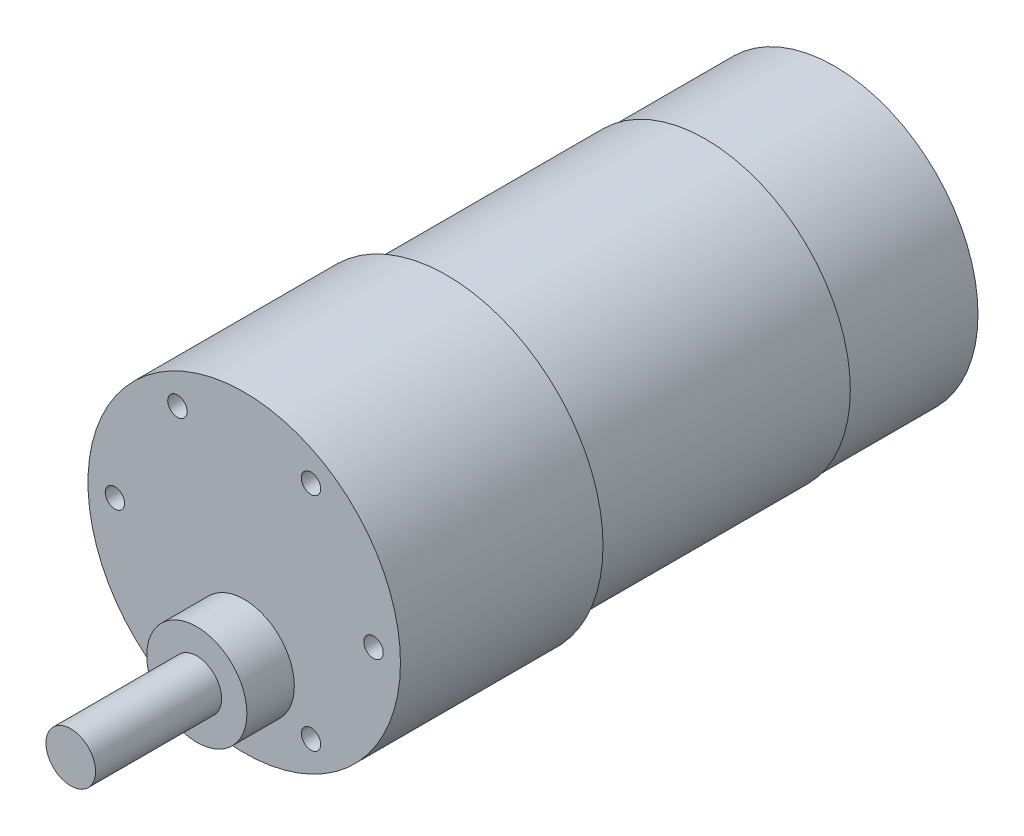
ISO-10303-21;
HEADER;
FILE_DESCRIPTION(('STEP AP214'),'2;1');
FILE_NAME('part.step','',(''),(''),'','','');
FILE_SCHEMA(('AUTOMOTIVE_DESIGN { 1 0 10303 214 1 1 1 1 }'));
ENDSEC;
DATA;
#1=APPLICATION_CONTEXT('core data for automotive mechanical design processes');
#2=APPLICATION_PROTOCOL_DEFINITION('international standard','automotive_design',2000,#1);
#3=PRODUCT_CONTEXT('',#1,'mechanical');
#4=PRODUCT('Part','Part','',(#3));
#5=PRODUCT_RELATED_PRODUCT_CATEGORY('part','',(#4));
#6=PRODUCT_DEFINITION_FORMATION('','',#4);
#7=PRODUCT_DEFINITION_CONTEXT('part definition',#1,'design');
#8=PRODUCT_DEFINITION('design','',#6,#7);
#9=PRODUCT_DEFINITION_SHAPE('','',#8);
#10=(LENGTH_UNIT() NAMED_UNIT(*) SI_UNIT(.MILLI.,.METRE.));
#11=(NAMED_UNIT(*) PLANE_ANGLE_UNIT() SI_UNIT($,.RADIAN.));
#12=(NAMED_UNIT(*) SI_UNIT($,.STERADIAN.) SOLID_ANGLE_UNIT());
#13=UNCERTAINTY_MEASURE_WITH_UNIT(LENGTH_MEASURE(1.E-05),#10,'distance_accuracy_value','');
#14=(GEOMETRIC_REPRESENTATION_CONTEXT(3) GLOBAL_UNCERTAINTY_ASSIGNED_CONTEXT((#13)) GLOBAL_UNIT_ASSIGNED_CONTEXT((#10,
#11,#12)) REPRESENTATION_CONTEXT('',''));
#15=CARTESIAN_POINT('',(0.,0.,0.));
#16=DIRECTION('',(0.,0.,1.));
#17=DIRECTION('',(1.,0.,0.));
#18=AXIS2_PLACEMENT_3D('',#15,#16,#17);
#19=CARTESIAN_POINT('',(0.,0.,-23.876));
#20=DIRECTION('',(0.,0.,1.));
#21=DIRECTION('',(1.,0.,0.));
#22=AXIS2_PLACEMENT_3D('',#19,#20,#21);
#23=CYLINDRICAL_SURFACE('',#22,18.415);
#24=CARTESIAN_POINT('',(0.,0.,-23.876));
#25=DIRECTION('',(0.,0.,1.));
#26=DIRECTION('',(1.,0.,0.));
#27=AXIS2_PLACEMENT_3D('',#24,#25,#26);
#28=CIRCLE('',#27,18.415);
#29=CARTESIAN_POINT('',(18.415,0.,-23.876));
#30=VERTEX_POINT('',#29);
#31=EDGE_CURVE('E160',#30,#30,#28,.T.);
#32=ORIENTED_EDGE('',*,*,#31,.T.);
#33=EDGE_LOOP('',(#32));
#34=FACE_BOUND('',#33,.T.);
#35=CARTESIAN_POINT('',(0.,0.,0.));
#36=DIRECTION('',(0.,0.,1.));
#37=DIRECTION('',(1.,0.,0.));
#38=AXIS2_PLACEMENT_3D('',#35,#36,#37);
#39=CIRCLE('',#38,18.415);
#40=CARTESIAN_POINT('',(18.415,0.,0.));
#41=VERTEX_POINT('',#40);
#42=EDGE_CURVE('E157',#41,#41,#39,.T.);
#43=ORIENTED_EDGE('',*,*,#42,.F.);
#44=EDGE_LOOP('',(#43));
#45=FACE_BOUND('',#44,.T.);
#46=ADVANCED_FACE('F33',(#34,#45),#23,.T.);
#47=CARTESIAN_POINT('',(0.,0.,-23.876));
#48=DIRECTION('',(0.,0.,1.));
#49=DIRECTION('',(1.,0.,0.));
#50=AXIS2_PLACEMENT_3D('',#47,#48,#49);
#51=PLANE('',#50);
#52=CARTESIAN_POINT('',(0.,0.,-23.876));
#53=DIRECTION('',(0.,0.,1.));
#54=DIRECTION('',(1.,0.,0.));
#55=AXIS2_PLACEMENT_3D('',#52,#53,#54);
#56=CIRCLE('',#55,17.0815);
#57=CARTESIAN_POINT('',(17.0815,0.,-23.876));
#58=VERTEX_POINT('',#57);
#59=EDGE_CURVE('E163',#58,#58,#56,.F.);
#60=ORIENTED_EDGE('',*,*,#59,.F.);
#61=EDGE_LOOP('',(#60));
#62=FACE_BOUND('',#61,.T.);
#63=ORIENTED_EDGE('',*,*,#31,.F.);
#64=EDGE_LOOP('',(#63));
#65=FACE_BOUND('',#64,.T.);
#66=ADVANCED_FACE('F187',(#62,#65),#51,.F.);
#67=CARTESIAN_POINT('',(0.,0.,0.));
#68=DIRECTION('',(0.,0.,1.));
#69=DIRECTION('',(1.,0.,0.));
#70=AXIS2_PLACEMENT_3D('',#67,#68,#69);
#71=PLANE('',#70);
#72=CARTESIAN_POINT('',(-7.87188333333333,-13.0495614020698,0.));
#73=DIRECTION('',(0.,0.,1.));
#74=DIRECTION('',(-1.,0.,0.));
#75=AXIS2_PLACEMENT_3D('',#72,#73,#74);
#76=CIRCLE('',#75,1.143);
#77=CARTESIAN_POINT('',(-9.01488333333333,-13.0495614020698,0.));
#78=VERTEX_POINT('',#77);
#79=EDGE_CURVE('E99',#78,#78,#76,.T.);
#80=ORIENTED_EDGE('',*,*,#79,.F.);
#81=EDGE_LOOP('',(#80));
#82=FACE_BOUND('',#81,.T.);
#83=CARTESIAN_POINT('',(-15.24,0.,0.));
#84=DIRECTION('',(0.,0.,1.));
#85=DIRECTION('',(-1.,0.,0.));
#86=AXIS2_PLACEMENT_3D('',#83,#84,#85);
#87=CIRCLE('',#86,1.143);
#88=CARTESIAN_POINT('',(-16.383,0.,0.));
#89=VERTEX_POINT('',#88);
#90=EDGE_CURVE('E106',#89,#89,#87,.T.);
#91=ORIENTED_EDGE('',*,*,#90,.F.);
#92=EDGE_LOOP('',(#91));
#93=FACE_BOUND('',#92,.T.);
#94=CARTESIAN_POINT('',(-7.87188333333333,13.0495614020698,0.));
#95=DIRECTION('',(0.,0.,1.));
#96=DIRECTION('',(-1.,0.,0.));
#97=AXIS2_PLACEMENT_3D('',#94,#95,#96);
#98=CIRCLE('',#97,1.143);
#99=CARTESIAN_POINT('',(-9.01488333333333,13.0495614020698,0.));
#100=VERTEX_POINT('',#99);
#101=EDGE_CURVE('E112',#100,#100,#98,.T.);
#102=ORIENTED_EDGE('',*,*,#101,.F.);
#103=EDGE_LOOP('',(#102));
#104=FACE_BOUND('',#103,.T.);
#105=CARTESIAN_POINT('',(7.87188333333333,13.0495614020698,0.));
#106=DIRECTION('',(0.,0.,1.));
#107=DIRECTION('',(1.,0.,0.));
#108=AXIS2_PLACEMENT_3D('',#105,#106,#107);
#109=CIRCLE('',#108,1.143);
#110=CARTESIAN_POINT('',(9.01488333333333,13.0495614020698,0.));
#111=VERTEX_POINT('',#110);
#112=EDGE_CURVE('E118',#111,#111,#109,.T.);
#113=ORIENTED_EDGE('',*,*,#112,.F.);
#114=EDGE_LOOP('',(#113));
#115=FACE_BOUND('',#114,.T.);
#116=CARTESIAN_POINT('',(15.24,0.,0.));
#117=DIRECTION('',(0.,0.,1.));
#118=DIRECTION('',(1.,0.,0.));
#119=AXIS2_PLACEMENT_3D('',#116,#117,#118);
#120=CIRCLE('',#119,1.143);
#121=CARTESIAN_POINT('',(16.383,0.,0.));
#122=VERTEX_POINT('',#121);
#123=EDGE_CURVE('E124',#122,#122,#120,.T.);
#124=ORIENTED_EDGE('',*,*,#123,.F.);
#125=EDGE_LOOP('',(#124));
#126=FACE_BOUND('',#125,.T.);
#127=CARTESIAN_POINT('',(7.87188333333333,-13.0495614020698,0.));
#128=DIRECTION('',(0.,0.,1.));
#129=DIRECTION('',(1.,0.,0.));
#130=AXIS2_PLACEMENT_3D('',#127,#128,#129);
#131=CIRCLE('',#130,1.143);
#132=CARTESIAN_POINT('',(9.01488333333333,-13.0495614020698,0.));
#133=VERTEX_POINT('',#132);
#134=EDGE_CURVE('E130',#133,#133,#131,.T.);
#135=ORIENTED_EDGE('',*,*,#134,.F.);
#136=EDGE_LOOP('',(#135));
#137=FACE_BOUND('',#136,.T.);
#138=CARTESIAN_POINT('',(0.,-8.636,0.));
#139=DIRECTION('',(0.,0.,1.));
#140=DIRECTION('',(1.,0.,0.));
#141=AXIS2_PLACEMENT_3D('',#138,#139,#140);
#142=CIRCLE('',#141,5.9055);
#143=CARTESIAN_POINT('',(5.9055,-8.636,0.));
#144=VERTEX_POINT('',#143);
#145=EDGE_CURVE('E151',#144,#144,#142,.T.);
#146=ORIENTED_EDGE('',*,*,#145,.F.);
#147=EDGE_LOOP('',(#146));
#148=FACE_BOUND('',#147,.T.);
#149=ORIENTED_EDGE('',*,*,#42,.T.);
#150=EDGE_LOOP('',(#149));
#151=FACE_BOUND('',#150,.T.);
#152=ADVANCED_FACE('F192',(#82,#93,#104,#115,#126,#137,#148,#151),#71,.T.);
#153=CARTESIAN_POINT('',(0.,-8.636,5.588));
#154=DIRECTION('',(0.,0.,-1.));
#155=DIRECTION('',(-1.,0.,0.));
#156=AXIS2_PLACEMENT_3D('',#153,#154,#155);
#157=CYLINDRICAL_SURFACE('',#156,5.9055);
#158=CARTESIAN_POINT('',(0.,-8.636,5.588));
#159=DIRECTION('',(0.,0.,1.));
#160=DIRECTION('',(1.,0.,0.));
#161=AXIS2_PLACEMENT_3D('',#158,#159,#160);
#162=CIRCLE('',#161,5.9055);
#163=CARTESIAN_POINT('',(5.9055,-8.636,5.588));
#164=VERTEX_POINT('',#163);
#165=EDGE_CURVE('E154',#164,#164,#162,.T.);
#166=ORIENTED_EDGE('',*,*,#165,.F.);
#167=EDGE_LOOP('',(#166));
#168=FACE_BOUND('',#167,.T.);
#169=ORIENTED_EDGE('',*,*,#145,.T.);
#170=EDGE_LOOP('',(#169));
#171=FACE_BOUND('',#170,.T.);
#172=ADVANCED_FACE('F200',(#168,#171),#157,.T.);
#173=CARTESIAN_POINT('',(0.,-8.636,5.588));
#174=DIRECTION('',(0.,0.,1.));
#175=DIRECTION('',(1.,0.,0.));
#176=AXIS2_PLACEMENT_3D('',#173,#174,#175);
#177=PLANE('',#176);
#178=CARTESIAN_POINT('',(0.,-8.636,5.588));
#179=DIRECTION('',(0.,0.,1.));
#180=DIRECTION('',(1.,0.,0.));
#181=AXIS2_PLACEMENT_3D('',#178,#179,#180);
#182=CIRCLE('',#181,2.921);
#183=CARTESIAN_POINT('',(2.921,-8.636,5.588));
#184=VERTEX_POINT('',#183);
#185=EDGE_CURVE('E147',#184,#184,#182,.T.);
#186=ORIENTED_EDGE('',*,*,#185,.F.);
#187=EDGE_LOOP('',(#186));
#188=FACE_BOUND('',#187,.T.);
#189=ORIENTED_EDGE('',*,*,#165,.T.);
#190=EDGE_LOOP('',(#189));
#191=FACE_BOUND('',#190,.T.);
#192=ADVANCED_FACE('F205',(#188,#191),#177,.T.);
#193=CARTESIAN_POINT('',(0.,-8.636,20.447));
#194=DIRECTION('',(0.,0.,-1.));
#195=DIRECTION('',(-1.,0.,0.));
#196=AXIS2_PLACEMENT_3D('',#193,#194,#195);
#197=CYLINDRICAL_SURFACE('',#196,2.921);
#198=CARTESIAN_POINT('',(0.,-8.636,20.447));
#199=DIRECTION('',(0.,0.,1.));
#200=DIRECTION('',(1.,0.,0.));
#201=AXIS2_PLACEMENT_3D('',#198,#199,#200);
#202=CIRCLE('',#201,2.921);
#203=CARTESIAN_POINT('',(2.921,-8.636,20.447));
#204=VERTEX_POINT('',#203);
#205=EDGE_CURVE('E148',#204,#204,#202,.T.);
#206=ORIENTED_EDGE('',*,*,#205,.F.);
#207=EDGE_LOOP('',(#206));
#208=FACE_BOUND('',#207,.T.);
#209=ORIENTED_EDGE('',*,*,#185,.T.);
#210=EDGE_LOOP('',(#209));
#211=FACE_BOUND('',#210,.T.);
#212=ADVANCED_FACE('F213',(#208,#211),#197,.T.);
#213=CARTESIAN_POINT('',(0.,-8.636,20.447));
#214=DIRECTION('',(0.,0.,1.));
#215=DIRECTION('',(1.,0.,0.));
#216=AXIS2_PLACEMENT_3D('',#213,#214,#215);
#217=PLANE('',#216);
#218=ORIENTED_EDGE('',*,*,#205,.T.);
#219=EDGE_LOOP('',(#218));
#220=FACE_BOUND('',#219,.T.);
#221=ADVANCED_FACE('F217',(#220),#217,.T.);
#222=CARTESIAN_POINT('',(0.,0.,-54.356));
#223=DIRECTION('',(0.,0.,1.));
#224=DIRECTION('',(1.,0.,0.));
#225=AXIS2_PLACEMENT_3D('',#222,#223,#224);
#226=CYLINDRICAL_SURFACE('',#225,17.0815);
#227=CARTESIAN_POINT('',(0.,0.,-54.356));
#228=DIRECTION('',(0.,0.,-1.));
#229=DIRECTION('',(-1.,0.,0.));
#230=AXIS2_PLACEMENT_3D('',#227,#228,#229);
#231=CIRCLE('',#230,17.0815);
#232=CARTESIAN_POINT('',(-17.0815,0.,-54.356));
#233=VERTEX_POINT('',#232);
#234=EDGE_CURVE('E142',#233,#233,#231,.T.);
#235=ORIENTED_EDGE('',*,*,#234,.F.);
#236=EDGE_LOOP('',(#235));
#237=FACE_BOUND('',#236,.T.);
#238=ORIENTED_EDGE('',*,*,#59,.T.);
#239=EDGE_LOOP('',(#238));
#240=FACE_BOUND('',#239,.T.);
#241=ADVANCED_FACE('F221',(#237,#240),#226,.T.);
#242=CARTESIAN_POINT('',(0.,0.,-54.356));
#243=DIRECTION('',(0.,0.,-1.));
#244=DIRECTION('',(-1.,0.,0.));
#245=AXIS2_PLACEMENT_3D('',#242,#243,#244);
#246=PLANE('',#245);
#247=CARTESIAN_POINT('',(0.,0.,-54.356));
#248=DIRECTION('',(0.,0.,-1.));
#249=DIRECTION('',(-1.,0.,0.));
#250=AXIS2_PLACEMENT_3D('',#247,#248,#249);
#251=CIRCLE('',#250,16.891);
#252=CARTESIAN_POINT('',(-16.891,0.,-54.356));
#253=VERTEX_POINT('',#252);
#254=EDGE_CURVE('E136',#253,#253,#251,.T.);
#255=ORIENTED_EDGE('',*,*,#254,.F.);
#256=EDGE_LOOP('',(#255));
#257=FACE_BOUND('',#256,.T.);
#258=ORIENTED_EDGE('',*,*,#234,.T.);
#259=EDGE_LOOP('',(#258));
#260=FACE_BOUND('',#259,.T.);
#261=ADVANCED_FACE('F225',(#257,#260),#246,.T.);
#262=CARTESIAN_POINT('',(0.,0.,-69.596));
#263=DIRECTION('',(0.,0.,1.));
#264=DIRECTION('',(1.,0.,0.));
#265=AXIS2_PLACEMENT_3D('',#262,#263,#264);
#266=CYLINDRICAL_SURFACE('',#265,16.891);
#267=DIRECTION('',(0.,0.,1.));
#268=VECTOR('',#267,1.);
#269=CARTESIAN_POINT('',(-7.11200000000007,-15.3207485783169,-69.5959999999999));
#270=LINE('',#269,#268);
#271=CARTESIAN_POINT('',(-7.11200000000001,-15.3207485783169,-60.579));
#272=VERTEX_POINT('',#271);
#273=CARTESIAN_POINT('',(-7.11199999999999,-15.3207485783169,-56.896));
#274=VERTEX_POINT('',#273);
#275=EDGE_CURVE('E11',#272,#274,#270,.T.);
#276=ORIENTED_EDGE('',*,*,#275,.T.);
#277=CARTESIAN_POINT('',(0.,0.,-56.896));
#278=DIRECTION('',(0.,0.,1.));
#279=DIRECTION('',(1.,0.,0.));
#280=AXIS2_PLACEMENT_3D('',#277,#278,#279);
#281=CIRCLE('',#280,16.891);
#282=CARTESIAN_POINT('',(7.11199999999999,-15.3207485783169,-56.896));
#283=VERTEX_POINT('',#282);
#284=EDGE_CURVE('E168',#274,#283,#281,.T.);
#285=ORIENTED_EDGE('',*,*,#284,.T.);
#286=DIRECTION('',(0.,0.,1.));
#287=VECTOR('',#286,1.);
#288=CARTESIAN_POINT('',(7.11199999999999,-15.3207485783169,-69.596));
#289=LINE('',#288,#287);
#290=CARTESIAN_POINT('',(7.11199999999999,-15.3207485783169,-60.579));
#291=VERTEX_POINT('',#290);
#292=EDGE_CURVE('E40',#283,#291,#289,.F.);
#293=ORIENTED_EDGE('',*,*,#292,.T.);
#294=CARTESIAN_POINT('',(0.,0.,-60.579));
#295=DIRECTION('',(0.,0.,-1.));
#296=DIRECTION('',(-1.,0.,0.));
#297=AXIS2_PLACEMENT_3D('',#294,#295,#296);
#298=CIRCLE('',#297,16.891);
#299=EDGE_CURVE('E55',#291,#272,#298,.T.);
#300=ORIENTED_EDGE('',*,*,#299,.T.);
#301=EDGE_LOOP('',(#276,#285,#293,#300));
#302=FACE_BOUND('',#301,.T.);
#303=CARTESIAN_POINT('',(0.,0.,-69.596));
#304=DIRECTION('',(0.,0.,-1.));
#305=DIRECTION('',(-1.,0.,0.));
#306=AXIS2_PLACEMENT_3D('',#303,#304,#305);
#307=CIRCLE('',#306,16.891);
#308=CARTESIAN_POINT('',(-16.891,0.,-69.596));
#309=VERTEX_POINT('',#308);
#310=EDGE_CURVE('E139',#309,#309,#307,.T.);
#311=ORIENTED_EDGE('',*,*,#310,.F.);
#312=EDGE_LOOP('',(#311));
#313=FACE_BOUND('',#312,.T.);
#314=ORIENTED_EDGE('',*,*,#254,.T.);
#315=EDGE_LOOP('',(#314));
#316=FACE_BOUND('',#315,.T.);
#317=ADVANCED_FACE('F171',(#302,#313,#316),#266,.T.);
#318=CARTESIAN_POINT('',(0.,0.,-69.596));
#319=DIRECTION('',(0.,0.,-1.));
#320=DIRECTION('',(-1.,0.,0.));
#321=AXIS2_PLACEMENT_3D('',#318,#319,#320);
#322=PLANE('',#321);
#323=ORIENTED_EDGE('',*,*,#310,.T.);
#324=EDGE_LOOP('',(#323));
#325=FACE_BOUND('',#324,.T.);
#326=ADVANCED_FACE('F232',(#325),#322,.T.);
#327=CARTESIAN_POINT('',(7.87188333333333,-13.0495614020698,-15.24));
#328=DIRECTION('',(0.,0.,1.));
#329=DIRECTION('',(1.,0.,0.));
#330=AXIS2_PLACEMENT_3D('',#327,#328,#329);
#331=CYLINDRICAL_SURFACE('',#330,1.143);
#332=CARTESIAN_POINT('',(7.87188333333333,-13.0495614020698,-15.24));
#333=DIRECTION('',(0.,0.,1.));
#334=DIRECTION('',(1.,0.,0.));
#335=AXIS2_PLACEMENT_3D('',#332,#333,#334);
#336=CIRCLE('',#335,1.143);
#337=CARTESIAN_POINT('',(9.01488333333333,-13.0495614020698,-15.24));
#338=VERTEX_POINT('',#337);
#339=EDGE_CURVE('E133',#338,#338,#336,.T.);
#340=ORIENTED_EDGE('',*,*,#339,.F.);
#341=EDGE_LOOP('',(#340));
#342=FACE_BOUND('',#341,.T.);
#343=ORIENTED_EDGE('',*,*,#134,.T.);
#344=EDGE_LOOP('',(#343));
#345=FACE_BOUND('',#344,.T.);
#346=ADVANCED_FACE('F235',(#342,#345),#331,.F.);
#347=CARTESIAN_POINT('',(7.87188333333333,-13.0495614020698,-15.24));
#348=DIRECTION('',(0.,0.,1.));
#349=DIRECTION('',(1.,0.,0.));
#350=AXIS2_PLACEMENT_3D('',#347,#348,#349);
#351=PLANE('',#350);
#352=ORIENTED_EDGE('',*,*,#339,.T.);
#353=EDGE_LOOP('',(#352));
#354=FACE_BOUND('',#353,.T.);
#355=ADVANCED_FACE('F239',(#354),#351,.T.);
#356=CARTESIAN_POINT('',(15.24,0.,-15.24));
#357=DIRECTION('',(0.,0.,1.));
#358=DIRECTION('',(1.,0.,0.));
#359=AXIS2_PLACEMENT_3D('',#356,#357,#358);
#360=CYLINDRICAL_SURFACE('',#359,1.143);
#361=CARTESIAN_POINT('',(15.24,0.,-15.24));
#362=DIRECTION('',(0.,0.,1.));
#363=DIRECTION('',(1.,0.,0.));
#364=AXIS2_PLACEMENT_3D('',#361,#362,#363);
#365=CIRCLE('',#364,1.143);
#366=CARTESIAN_POINT('',(16.383,0.,-15.24));
#367=VERTEX_POINT('',#366);
#368=EDGE_CURVE('E127',#367,#367,#365,.T.);
#369=ORIENTED_EDGE('',*,*,#368,.F.);
#370=EDGE_LOOP('',(#369));
#371=FACE_BOUND('',#370,.T.);
#372=ORIENTED_EDGE('',*,*,#123,.T.);
#373=EDGE_LOOP('',(#372));
#374=FACE_BOUND('',#373,.T.);
#375=ADVANCED_FACE('F243',(#371,#374),#360,.F.);
#376=CARTESIAN_POINT('',(15.24,0.,-15.24));
#377=DIRECTION('',(0.,0.,1.));
#378=DIRECTION('',(1.,0.,0.));
#379=AXIS2_PLACEMENT_3D('',#376,#377,#378);
#380=PLANE('',#379);
#381=ORIENTED_EDGE('',*,*,#368,.T.);
#382=EDGE_LOOP('',(#381));
#383=FACE_BOUND('',#382,.T.);
#384=ADVANCED_FACE('F247',(#383),#380,.T.);
#385=CARTESIAN_POINT('',(7.87188333333333,13.0495614020698,-15.24));
#386=DIRECTION('',(0.,0.,1.));
#387=DIRECTION('',(1.,0.,0.));
#388=AXIS2_PLACEMENT_3D('',#385,#386,#387);
#389=CYLINDRICAL_SURFACE('',#388,1.143);
#390=CARTESIAN_POINT('',(7.87188333333333,13.0495614020698,-15.24));
#391=DIRECTION('',(0.,0.,1.));
#392=DIRECTION('',(1.,0.,0.));
#393=AXIS2_PLACEMENT_3D('',#390,#391,#392);
#394=CIRCLE('',#393,1.143);
#395=CARTESIAN_POINT('',(9.01488333333333,13.0495614020698,-15.24));
#396=VERTEX_POINT('',#395);
#397=EDGE_CURVE('E121',#396,#396,#394,.T.);
#398=ORIENTED_EDGE('',*,*,#397,.F.);
#399=EDGE_LOOP('',(#398));
#400=FACE_BOUND('',#399,.T.);
#401=ORIENTED_EDGE('',*,*,#112,.T.);
#402=EDGE_LOOP('',(#401));
#403=FACE_BOUND('',#402,.T.);
#404=ADVANCED_FACE('F251',(#400,#403),#389,.F.);
#405=CARTESIAN_POINT('',(7.87188333333333,13.0495614020698,-15.24));
#406=DIRECTION('',(0.,0.,1.));
#407=DIRECTION('',(1.,0.,0.));
#408=AXIS2_PLACEMENT_3D('',#405,#406,#407);
#409=PLANE('',#408);
#410=ORIENTED_EDGE('',*,*,#397,.T.);
#411=EDGE_LOOP('',(#410));
#412=FACE_BOUND('',#411,.T.);
#413=ADVANCED_FACE('F255',(#412),#409,.T.);
#414=CARTESIAN_POINT('',(-7.87188333333333,13.0495614020698,-15.24));
#415=DIRECTION('',(0.,0.,1.));
#416=DIRECTION('',(1.,0.,0.));
#417=AXIS2_PLACEMENT_3D('',#414,#415,#416);
#418=CYLINDRICAL_SURFACE('',#417,1.143);
#419=CARTESIAN_POINT('',(-7.87188333333333,13.0495614020698,-15.24));
#420=DIRECTION('',(0.,0.,1.));
#421=DIRECTION('',(-1.,0.,0.));
#422=AXIS2_PLACEMENT_3D('',#419,#420,#421);
#423=CIRCLE('',#422,1.143);
#424=CARTESIAN_POINT('',(-9.01488333333333,13.0495614020698,-15.24));
#425=VERTEX_POINT('',#424);
#426=EDGE_CURVE('E115',#425,#425,#423,.T.);
#427=ORIENTED_EDGE('',*,*,#426,.F.);
#428=EDGE_LOOP('',(#427));
#429=FACE_BOUND('',#428,.T.);
#430=ORIENTED_EDGE('',*,*,#101,.T.);
#431=EDGE_LOOP('',(#430));
#432=FACE_BOUND('',#431,.T.);
#433=ADVANCED_FACE('F259',(#429,#432),#418,.F.);
#434=CARTESIAN_POINT('',(-7.87188333333333,13.0495614020698,-15.24));
#435=DIRECTION('',(0.,0.,1.));
#436=DIRECTION('',(-1.,0.,0.));
#437=AXIS2_PLACEMENT_3D('',#434,#435,#436);
#438=PLANE('',#437);
#439=ORIENTED_EDGE('',*,*,#426,.T.);
#440=EDGE_LOOP('',(#439));
#441=FACE_BOUND('',#440,.T.);
#442=ADVANCED_FACE('F263',(#441),#438,.T.);
#443=CARTESIAN_POINT('',(-15.24,0.,-15.24));
#444=DIRECTION('',(0.,0.,1.));
#445=DIRECTION('',(1.,0.,0.));
#446=AXIS2_PLACEMENT_3D('',#443,#444,#445);
#447=CYLINDRICAL_SURFACE('',#446,1.143);
#448=CARTESIAN_POINT('',(-15.24,0.,-15.24));
#449=DIRECTION('',(0.,0.,1.));
#450=DIRECTION('',(-1.,0.,0.));
#451=AXIS2_PLACEMENT_3D('',#448,#449,#450);
#452=CIRCLE('',#451,1.143);
#453=CARTESIAN_POINT('',(-16.383,0.,-15.24));
#454=VERTEX_POINT('',#453);
#455=EDGE_CURVE('E109',#454,#454,#452,.T.);
#456=ORIENTED_EDGE('',*,*,#455,.F.);
#457=EDGE_LOOP('',(#456));
#458=FACE_BOUND('',#457,.T.);
#459=ORIENTED_EDGE('',*,*,#90,.T.);
#460=EDGE_LOOP('',(#459));
#461=FACE_BOUND('',#460,.T.);
#462=ADVANCED_FACE('F267',(#458,#461),#447,.F.);
#463=CARTESIAN_POINT('',(-15.24,0.,-15.24));
#464=DIRECTION('',(0.,0.,1.));
#465=DIRECTION('',(-1.,0.,0.));
#466=AXIS2_PLACEMENT_3D('',#463,#464,#465);
#467=PLANE('',#466);
#468=ORIENTED_EDGE('',*,*,#455,.T.);
#469=EDGE_LOOP('',(#468));
#470=FACE_BOUND('',#469,.T.);
#471=ADVANCED_FACE('F271',(#470),#467,.T.);
#472=CARTESIAN_POINT('',(-7.87188333333333,-13.0495614020698,-15.24));
#473=DIRECTION('',(0.,0.,1.));
#474=DIRECTION('',(1.,0.,0.));
#475=AXIS2_PLACEMENT_3D('',#472,#473,#474);
#476=CYLINDRICAL_SURFACE('',#475,1.143);
#477=CARTESIAN_POINT('',(-7.87188333333333,-13.0495614020698,-15.24));
#478=DIRECTION('',(0.,0.,1.));
#479=DIRECTION('',(-1.,0.,0.));
#480=AXIS2_PLACEMENT_3D('',#477,#478,#479);
#481=CIRCLE('',#480,1.143);
#482=CARTESIAN_POINT('',(-9.01488333333333,-13.0495614020698,-15.24));
#483=VERTEX_POINT('',#482);
#484=EDGE_CURVE('E103',#483,#483,#481,.T.);
#485=ORIENTED_EDGE('',*,*,#484,.F.);
#486=EDGE_LOOP('',(#485));
#487=FACE_BOUND('',#486,.T.);
#488=ORIENTED_EDGE('',*,*,#79,.T.);
#489=EDGE_LOOP('',(#488));
#490=FACE_BOUND('',#489,.T.);
#491=ADVANCED_FACE('F275',(#487,#490),#476,.F.);
#492=CARTESIAN_POINT('',(-7.87188333333333,-13.0495614020698,-15.24));
#493=DIRECTION('',(0.,0.,1.));
#494=DIRECTION('',(-1.,0.,0.));
#495=AXIS2_PLACEMENT_3D('',#492,#493,#494);
#496=PLANE('',#495);
#497=ORIENTED_EDGE('',*,*,#484,.T.);
#498=EDGE_LOOP('',(#497));
#499=FACE_BOUND('',#498,.T.);
#500=ADVANCED_FACE('F183',(#499),#496,.T.);
#501=CARTESIAN_POINT('',(7.11199999999999,-14.351,-60.579));
#502=DIRECTION('',(1.,0.,0.));
#503=DIRECTION('',(0.,0.,-1.));
#504=AXIS2_PLACEMENT_3D('',#501,#502,#503);
#505=PLANE('',#504);
#506=DIRECTION('',(0.,-1.,0.));
#507=VECTOR('',#506,1.);
#508=CARTESIAN_POINT('',(7.11199999999999,-14.351,-56.896));
#509=LINE('',#508,#507);
#510=CARTESIAN_POINT('',(7.11199999999999,-14.351,-56.896));
#511=VERTEX_POINT('',#510);
#512=EDGE_CURVE('E47',#511,#283,#509,.T.);
#513=ORIENTED_EDGE('',*,*,#512,.F.);
#514=DIRECTION('',(0.,0.,1.));
#515=VECTOR('',#514,1.);
#516=CARTESIAN_POINT('',(7.11199999999999,-14.351,-60.579));
#517=LINE('',#516,#515);
#518=CARTESIAN_POINT('',(7.11199999999999,-14.351,-60.579));
#519=VERTEX_POINT('',#518);
#520=EDGE_CURVE('E75',#519,#511,#517,.T.);
#521=ORIENTED_EDGE('',*,*,#520,.F.);
#522=DIRECTION('',(0.,-1.,0.));
#523=VECTOR('',#522,1.);
#524=CARTESIAN_POINT('',(7.11199999999999,-14.351,-60.579));
#525=LINE('',#524,#523);
#526=EDGE_CURVE('E97',#519,#291,#525,.T.);
#527=ORIENTED_EDGE('',*,*,#526,.T.);
#528=ORIENTED_EDGE('',*,*,#292,.F.);
#529=EDGE_LOOP('',(#513,#521,#527,#528));
#530=FACE_BOUND('',#529,.T.);
#531=ADVANCED_FACE('F73',(#530),#505,.F.);
#532=CARTESIAN_POINT('',(7.11199999999999,-14.351,-60.579));
#533=DIRECTION('',(0.,0.,-1.));
#534=DIRECTION('',(-1.,0.,0.));
#535=AXIS2_PLACEMENT_3D('',#532,#533,#534);
#536=PLANE('',#535);
#537=ORIENTED_EDGE('',*,*,#526,.F.);
#538=DIRECTION('',(1.,0.,0.));
#539=VECTOR('',#538,1.);
#540=CARTESIAN_POINT('',(7.11199999999999,-14.351,-60.579));
#541=LINE('',#540,#539);
#542=CARTESIAN_POINT('',(-7.11200000000001,-14.351,-60.579));
#543=VERTEX_POINT('',#542);
#544=EDGE_CURVE('E80',#543,#519,#541,.T.);
#545=ORIENTED_EDGE('',*,*,#544,.F.);
#546=DIRECTION('',(0.,-1.,0.));
#547=VECTOR('',#546,1.);
#548=CARTESIAN_POINT('',(-7.11200000000001,-14.351,-60.579));
#549=LINE('',#548,#547);
#550=EDGE_CURVE('E100',#543,#272,#549,.T.);
#551=ORIENTED_EDGE('',*,*,#550,.T.);
#552=ORIENTED_EDGE('',*,*,#299,.F.);
#553=EDGE_LOOP('',(#537,#545,#551,#552));
#554=FACE_BOUND('',#553,.T.);
#555=ADVANCED_FACE('F175',(#554),#536,.F.);
#556=CARTESIAN_POINT('',(-7.11200000000001,-14.351,-60.579));
#557=DIRECTION('',(-1.,0.,0.));
#558=DIRECTION('',(0.,0.,1.));
#559=AXIS2_PLACEMENT_3D('',#556,#557,#558);
#560=PLANE('',#559);
#561=ORIENTED_EDGE('',*,*,#550,.F.);
#562=DIRECTION('',(0.,0.,-1.));
#563=VECTOR('',#562,1.);
#564=CARTESIAN_POINT('',(-7.11200000000001,-14.351,-60.579));
#565=LINE('',#564,#563);
#566=CARTESIAN_POINT('',(-7.11199999999999,-14.351,-56.896));
#567=VERTEX_POINT('',#566);
#568=EDGE_CURVE('E89',#567,#543,#565,.T.);
#569=ORIENTED_EDGE('',*,*,#568,.F.);
#570=DIRECTION('',(0.,-1.,0.));
#571=VECTOR('',#570,1.);
#572=CARTESIAN_POINT('',(-7.11199999999999,-14.351,-56.896));
#573=LINE('',#572,#571);
#574=EDGE_CURVE('E79',#567,#274,#573,.T.);
#575=ORIENTED_EDGE('',*,*,#574,.T.);
#576=ORIENTED_EDGE('',*,*,#275,.F.);
#577=EDGE_LOOP('',(#561,#569,#575,#576));
#578=FACE_BOUND('',#577,.T.);
#579=ADVANCED_FACE('F174',(#578),#560,.F.);
#580=CARTESIAN_POINT('',(7.11199999999999,-14.351,-56.896));
#581=DIRECTION('',(0.,0.,1.));
#582=DIRECTION('',(1.,0.,0.));
#583=AXIS2_PLACEMENT_3D('',#580,#581,#582);
#584=PLANE('',#583);
#585=ORIENTED_EDGE('',*,*,#574,.F.);
#586=DIRECTION('',(-1.,0.,0.));
#587=VECTOR('',#586,1.);
#588=CARTESIAN_POINT('',(7.11199999999999,-14.351,-56.896));
#589=LINE('',#588,#587);
#590=EDGE_CURVE('E83',#511,#567,#589,.T.);
#591=ORIENTED_EDGE('',*,*,#590,.F.);
#592=ORIENTED_EDGE('',*,*,#512,.T.);
#593=ORIENTED_EDGE('',*,*,#284,.F.);
#594=EDGE_LOOP('',(#585,#591,#592,#593));
#595=FACE_BOUND('',#594,.T.);
#596=ADVANCED_FACE('F84',(#595),#584,.F.);
#597=CARTESIAN_POINT('',(0.,-14.351,0.));
#598=DIRECTION('',(0.,-1.,0.));
#599=DIRECTION('',(0.,0.,-1.));
#600=AXIS2_PLACEMENT_3D('',#597,#598,#599);
#601=PLANE('',#600);
#602=ORIENTED_EDGE('',*,*,#520,.T.);
#603=ORIENTED_EDGE('',*,*,#590,.T.);
#604=ORIENTED_EDGE('',*,*,#568,.T.);
#605=ORIENTED_EDGE('',*,*,#544,.T.);
#606=EDGE_LOOP('',(#602,#603,#604,#605));
#607=FACE_BOUND('',#606,.T.);
#608=ADVANCED_FACE('F91',(#607),#601,.T.);
#609=CLOSED_SHELL('',(#46,#66,#152,#172,#192,#212,#221,#241,#261,#317,#326,#346,#355,#375,#384,
#404,#413,#433,#442,#462,#471,#491,#500,#531,#555,#579,#596,#608));
#610=MANIFOLD_SOLID_BREP('B2',#609);
#611=ADVANCED_BREP_SHAPE_REPRESENTATION('',(#18,#610),#14);
#612=SHAPE_DEFINITION_REPRESENTATION(#9,#611);
ENDSEC;
END-ISO-10303-21;
